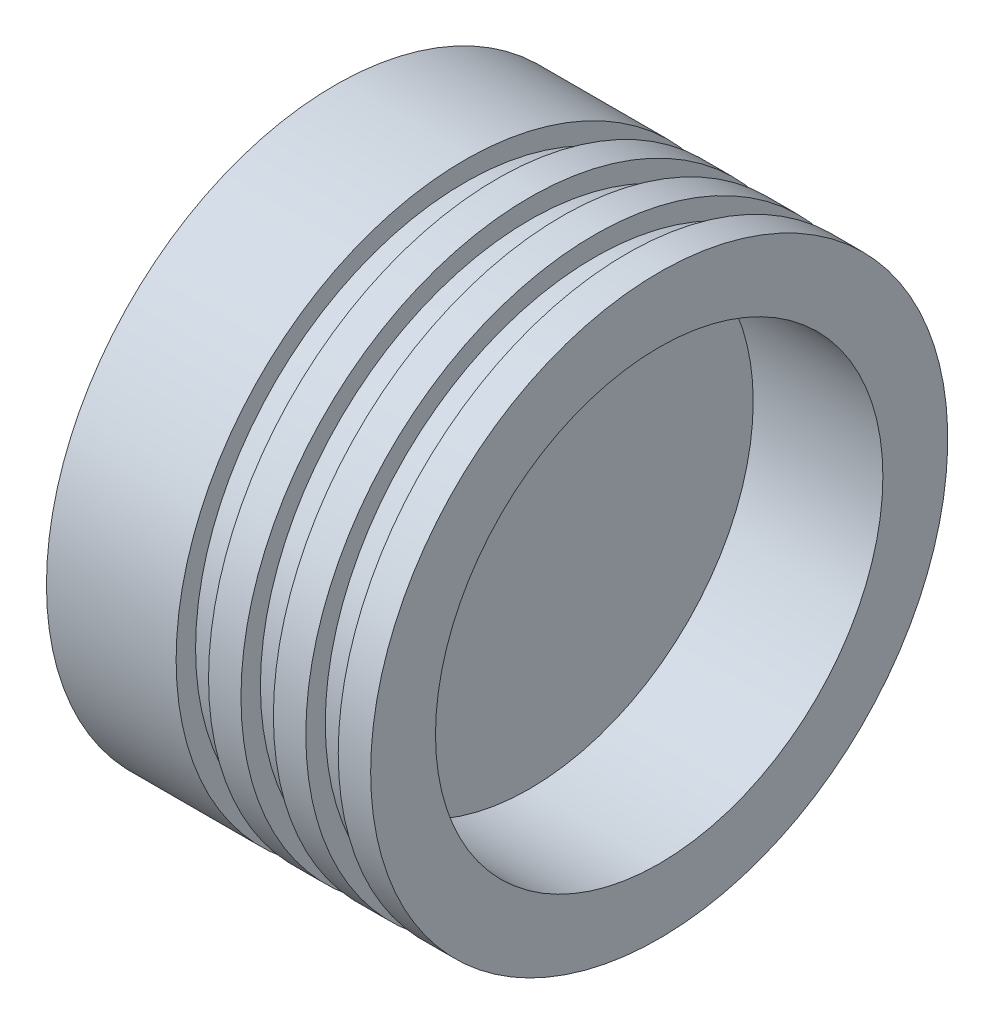
ISO-10303-21;
HEADER;
FILE_DESCRIPTION(('STEP AP214'),'2;1');
FILE_NAME('part.step','',(''),(''),'','','');
FILE_SCHEMA(('AUTOMOTIVE_DESIGN { 1 0 10303 214 1 1 1 1 }'));
ENDSEC;
DATA;
#1=APPLICATION_CONTEXT('core data for automotive mechanical design processes');
#2=APPLICATION_PROTOCOL_DEFINITION('international standard','automotive_design',2000,#1);
#3=PRODUCT_CONTEXT('',#1,'mechanical');
#4=PRODUCT('Part','Part','',(#3));
#5=PRODUCT_RELATED_PRODUCT_CATEGORY('part','',(#4));
#6=PRODUCT_DEFINITION_FORMATION('','',#4);
#7=PRODUCT_DEFINITION_CONTEXT('part definition',#1,'design');
#8=PRODUCT_DEFINITION('design','',#6,#7);
#9=PRODUCT_DEFINITION_SHAPE('','',#8);
#10=(LENGTH_UNIT() NAMED_UNIT(*) SI_UNIT(.MILLI.,.METRE.));
#11=(NAMED_UNIT(*) PLANE_ANGLE_UNIT() SI_UNIT($,.RADIAN.));
#12=(NAMED_UNIT(*) SI_UNIT($,.STERADIAN.) SOLID_ANGLE_UNIT());
#13=UNCERTAINTY_MEASURE_WITH_UNIT(LENGTH_MEASURE(1.E-05),#10,'distance_accuracy_value','');
#14=(GEOMETRIC_REPRESENTATION_CONTEXT(3) GLOBAL_UNCERTAINTY_ASSIGNED_CONTEXT((#13)) GLOBAL_UNIT_ASSIGNED_CONTEXT((#10,
#11,#12)) REPRESENTATION_CONTEXT('',''));
#15=CARTESIAN_POINT('',(0.,0.,0.));
#16=DIRECTION('',(0.,0.,1.));
#17=DIRECTION('',(1.,0.,0.));
#18=AXIS2_PLACEMENT_3D('',#15,#16,#17);
#19=CARTESIAN_POINT('',(0.,0.,0.));
#20=DIRECTION('',(1.,0.,0.));
#21=DIRECTION('',(0.,0.,-1.));
#22=AXIS2_PLACEMENT_3D('',#19,#20,#21);
#23=PLANE('',#22);
#24=CARTESIAN_POINT('',(0.,0.,0.));
#25=DIRECTION('',(-1.,0.,0.));
#26=DIRECTION('',(0.,0.,1.));
#27=AXIS2_PLACEMENT_3D('',#24,#25,#26);
#28=CIRCLE('',#27,44.5);
#29=CARTESIAN_POINT('',(0.,0.,44.5));
#30=VERTEX_POINT('',#29);
#31=EDGE_CURVE('E10',#30,#30,#28,.T.);
#32=ORIENTED_EDGE('',*,*,#31,.T.);
#33=EDGE_LOOP('',(#32));
#34=FACE_BOUND('',#33,.T.);
#35=ADVANCED_FACE('F35',(#34),#23,.F.);
#36=CARTESIAN_POINT('',(0.,0.,0.));
#37=DIRECTION('',(-1.,0.,0.));
#38=DIRECTION('',(0.,0.,1.));
#39=AXIS2_PLACEMENT_3D('',#36,#37,#38);
#40=CYLINDRICAL_SURFACE('',#39,44.5);
#41=ORIENTED_EDGE('',*,*,#31,.F.);
#42=EDGE_LOOP('',(#41));
#43=FACE_BOUND('',#42,.T.);
#44=CARTESIAN_POINT('',(20.,0.,0.));
#45=DIRECTION('',(-1.,0.,0.));
#46=DIRECTION('',(0.,0.,1.));
#47=AXIS2_PLACEMENT_3D('',#44,#45,#46);
#48=CIRCLE('',#47,44.5);
#49=CARTESIAN_POINT('',(20.,0.,44.5));
#50=VERTEX_POINT('',#49);
#51=EDGE_CURVE('E41',#50,#50,#48,.T.);
#52=ORIENTED_EDGE('',*,*,#51,.T.);
#53=EDGE_LOOP('',(#52));
#54=FACE_BOUND('',#53,.T.);
#55=ADVANCED_FACE('F103',(#43,#54),#40,.T.);
#56=CARTESIAN_POINT('',(20.,44.5,0.));
#57=DIRECTION('',(-1.,0.,0.));
#58=DIRECTION('',(0.,0.,1.));
#59=AXIS2_PLACEMENT_3D('',#56,#57,#58);
#60=PLANE('',#59);
#61=ORIENTED_EDGE('',*,*,#51,.F.);
#62=EDGE_LOOP('',(#61));
#63=FACE_BOUND('',#62,.T.);
#64=CARTESIAN_POINT('',(20.,0.,0.));
#65=DIRECTION('',(-1.,0.,0.));
#66=DIRECTION('',(0.,0.,1.));
#67=AXIS2_PLACEMENT_3D('',#64,#65,#66);
#68=CIRCLE('',#67,41.5);
#69=CARTESIAN_POINT('',(20.,0.,41.5));
#70=VERTEX_POINT('',#69);
#71=EDGE_CURVE('E45',#70,#70,#68,.T.);
#72=ORIENTED_EDGE('',*,*,#71,.T.);
#73=EDGE_LOOP('',(#72));
#74=FACE_BOUND('',#73,.T.);
#75=ADVANCED_FACE('F107',(#63,#74),#60,.F.);
#76=CARTESIAN_POINT('',(0.,0.,0.));
#77=DIRECTION('',(-1.,0.,0.));
#78=DIRECTION('',(0.,0.,1.));
#79=AXIS2_PLACEMENT_3D('',#76,#77,#78);
#80=CYLINDRICAL_SURFACE('',#79,41.5);
#81=ORIENTED_EDGE('',*,*,#71,.F.);
#82=EDGE_LOOP('',(#81));
#83=FACE_BOUND('',#82,.T.);
#84=CARTESIAN_POINT('',(25.,0.,0.));
#85=DIRECTION('',(-1.,0.,0.));
#86=DIRECTION('',(0.,0.,1.));
#87=AXIS2_PLACEMENT_3D('',#84,#85,#86);
#88=CIRCLE('',#87,41.5);
#89=CARTESIAN_POINT('',(25.,0.,41.5));
#90=VERTEX_POINT('',#89);
#91=EDGE_CURVE('E49',#90,#90,#88,.T.);
#92=ORIENTED_EDGE('',*,*,#91,.T.);
#93=EDGE_LOOP('',(#92));
#94=FACE_BOUND('',#93,.T.);
#95=ADVANCED_FACE('F112',(#83,#94),#80,.T.);
#96=CARTESIAN_POINT('',(25.,41.5,0.));
#97=DIRECTION('',(1.,0.,0.));
#98=DIRECTION('',(0.,0.,-1.));
#99=AXIS2_PLACEMENT_3D('',#96,#97,#98);
#100=PLANE('',#99);
#101=ORIENTED_EDGE('',*,*,#91,.F.);
#102=EDGE_LOOP('',(#101));
#103=FACE_BOUND('',#102,.T.);
#104=CARTESIAN_POINT('',(25.,0.,0.));
#105=DIRECTION('',(-1.,0.,0.));
#106=DIRECTION('',(0.,0.,1.));
#107=AXIS2_PLACEMENT_3D('',#104,#105,#106);
#108=CIRCLE('',#107,44.5);
#109=CARTESIAN_POINT('',(25.,0.,44.5));
#110=VERTEX_POINT('',#109);
#111=EDGE_CURVE('E54',#110,#110,#108,.T.);
#112=ORIENTED_EDGE('',*,*,#111,.T.);
#113=EDGE_LOOP('',(#112));
#114=FACE_BOUND('',#113,.T.);
#115=ADVANCED_FACE('F118',(#103,#114),#100,.F.);
#116=CARTESIAN_POINT('',(0.,0.,0.));
#117=DIRECTION('',(-1.,0.,0.));
#118=DIRECTION('',(0.,0.,1.));
#119=AXIS2_PLACEMENT_3D('',#116,#117,#118);
#120=CYLINDRICAL_SURFACE('',#119,44.5);
#121=ORIENTED_EDGE('',*,*,#111,.F.);
#122=EDGE_LOOP('',(#121));
#123=FACE_BOUND('',#122,.T.);
#124=CARTESIAN_POINT('',(30.,0.,0.));
#125=DIRECTION('',(-1.,0.,0.));
#126=DIRECTION('',(0.,0.,1.));
#127=AXIS2_PLACEMENT_3D('',#124,#125,#126);
#128=CIRCLE('',#127,44.5);
#129=CARTESIAN_POINT('',(30.,0.,44.5));
#130=VERTEX_POINT('',#129);
#131=EDGE_CURVE('E57',#130,#130,#128,.T.);
#132=ORIENTED_EDGE('',*,*,#131,.T.);
#133=EDGE_LOOP('',(#132));
#134=FACE_BOUND('',#133,.T.);
#135=ADVANCED_FACE('F122',(#123,#134),#120,.T.);
#136=CARTESIAN_POINT('',(30.,44.5,0.));
#137=DIRECTION('',(-1.,0.,0.));
#138=DIRECTION('',(0.,0.,1.));
#139=AXIS2_PLACEMENT_3D('',#136,#137,#138);
#140=PLANE('',#139);
#141=ORIENTED_EDGE('',*,*,#131,.F.);
#142=EDGE_LOOP('',(#141));
#143=FACE_BOUND('',#142,.T.);
#144=CARTESIAN_POINT('',(30.,0.,0.));
#145=DIRECTION('',(-1.,0.,0.));
#146=DIRECTION('',(0.,0.,1.));
#147=AXIS2_PLACEMENT_3D('',#144,#145,#146);
#148=CIRCLE('',#147,41.5);
#149=CARTESIAN_POINT('',(30.,0.,41.5));
#150=VERTEX_POINT('',#149);
#151=EDGE_CURVE('E60',#150,#150,#148,.T.);
#152=ORIENTED_EDGE('',*,*,#151,.T.);
#153=EDGE_LOOP('',(#152));
#154=FACE_BOUND('',#153,.T.);
#155=ADVANCED_FACE('F126',(#143,#154),#140,.F.);
#156=CARTESIAN_POINT('',(0.,0.,0.));
#157=DIRECTION('',(-1.,0.,0.));
#158=DIRECTION('',(0.,0.,1.));
#159=AXIS2_PLACEMENT_3D('',#156,#157,#158);
#160=CYLINDRICAL_SURFACE('',#159,41.5);
#161=ORIENTED_EDGE('',*,*,#151,.F.);
#162=EDGE_LOOP('',(#161));
#163=FACE_BOUND('',#162,.T.);
#164=CARTESIAN_POINT('',(35.,0.,0.));
#165=DIRECTION('',(-1.,0.,0.));
#166=DIRECTION('',(0.,0.,1.));
#167=AXIS2_PLACEMENT_3D('',#164,#165,#166);
#168=CIRCLE('',#167,41.5);
#169=CARTESIAN_POINT('',(35.,0.,41.5));
#170=VERTEX_POINT('',#169);
#171=EDGE_CURVE('E63',#170,#170,#168,.T.);
#172=ORIENTED_EDGE('',*,*,#171,.T.);
#173=EDGE_LOOP('',(#172));
#174=FACE_BOUND('',#173,.T.);
#175=ADVANCED_FACE('F130',(#163,#174),#160,.T.);
#176=CARTESIAN_POINT('',(35.,41.5,0.));
#177=DIRECTION('',(1.,0.,0.));
#178=DIRECTION('',(0.,0.,-1.));
#179=AXIS2_PLACEMENT_3D('',#176,#177,#178);
#180=PLANE('',#179);
#181=ORIENTED_EDGE('',*,*,#171,.F.);
#182=EDGE_LOOP('',(#181));
#183=FACE_BOUND('',#182,.T.);
#184=CARTESIAN_POINT('',(35.,0.,0.));
#185=DIRECTION('',(-1.,0.,0.));
#186=DIRECTION('',(0.,0.,1.));
#187=AXIS2_PLACEMENT_3D('',#184,#185,#186);
#188=CIRCLE('',#187,44.5);
#189=CARTESIAN_POINT('',(35.,0.,44.5));
#190=VERTEX_POINT('',#189);
#191=EDGE_CURVE('E66',#190,#190,#188,.T.);
#192=ORIENTED_EDGE('',*,*,#191,.T.);
#193=EDGE_LOOP('',(#192));
#194=FACE_BOUND('',#193,.T.);
#195=ADVANCED_FACE('F134',(#183,#194),#180,.F.);
#196=CARTESIAN_POINT('',(0.,0.,0.));
#197=DIRECTION('',(-1.,0.,0.));
#198=DIRECTION('',(0.,0.,1.));
#199=AXIS2_PLACEMENT_3D('',#196,#197,#198);
#200=CYLINDRICAL_SURFACE('',#199,44.5);
#201=ORIENTED_EDGE('',*,*,#191,.F.);
#202=EDGE_LOOP('',(#201));
#203=FACE_BOUND('',#202,.T.);
#204=CARTESIAN_POINT('',(40.,0.,0.));
#205=DIRECTION('',(-1.,0.,0.));
#206=DIRECTION('',(0.,0.,1.));
#207=AXIS2_PLACEMENT_3D('',#204,#205,#206);
#208=CIRCLE('',#207,44.5);
#209=CARTESIAN_POINT('',(40.,0.,44.5));
#210=VERTEX_POINT('',#209);
#211=EDGE_CURVE('E69',#210,#210,#208,.T.);
#212=ORIENTED_EDGE('',*,*,#211,.T.);
#213=EDGE_LOOP('',(#212));
#214=FACE_BOUND('',#213,.T.);
#215=ADVANCED_FACE('F138',(#203,#214),#200,.T.);
#216=CARTESIAN_POINT('',(40.,44.5,0.));
#217=DIRECTION('',(-1.,0.,0.));
#218=DIRECTION('',(0.,0.,1.));
#219=AXIS2_PLACEMENT_3D('',#216,#217,#218);
#220=PLANE('',#219);
#221=ORIENTED_EDGE('',*,*,#211,.F.);
#222=EDGE_LOOP('',(#221));
#223=FACE_BOUND('',#222,.T.);
#224=CARTESIAN_POINT('',(40.,0.,0.));
#225=DIRECTION('',(-1.,0.,0.));
#226=DIRECTION('',(0.,0.,1.));
#227=AXIS2_PLACEMENT_3D('',#224,#225,#226);
#228=CIRCLE('',#227,41.5);
#229=CARTESIAN_POINT('',(40.,0.,41.5));
#230=VERTEX_POINT('',#229);
#231=EDGE_CURVE('E72',#230,#230,#228,.T.);
#232=ORIENTED_EDGE('',*,*,#231,.T.);
#233=EDGE_LOOP('',(#232));
#234=FACE_BOUND('',#233,.T.);
#235=ADVANCED_FACE('F142',(#223,#234),#220,.F.);
#236=CARTESIAN_POINT('',(0.,0.,0.));
#237=DIRECTION('',(-1.,0.,0.));
#238=DIRECTION('',(0.,0.,1.));
#239=AXIS2_PLACEMENT_3D('',#236,#237,#238);
#240=CYLINDRICAL_SURFACE('',#239,41.5);
#241=ORIENTED_EDGE('',*,*,#231,.F.);
#242=EDGE_LOOP('',(#241));
#243=FACE_BOUND('',#242,.T.);
#244=CARTESIAN_POINT('',(45.,0.,0.));
#245=DIRECTION('',(-1.,0.,0.));
#246=DIRECTION('',(0.,0.,1.));
#247=AXIS2_PLACEMENT_3D('',#244,#245,#246);
#248=CIRCLE('',#247,41.5);
#249=CARTESIAN_POINT('',(45.,0.,41.5));
#250=VERTEX_POINT('',#249);
#251=EDGE_CURVE('E75',#250,#250,#248,.T.);
#252=ORIENTED_EDGE('',*,*,#251,.T.);
#253=EDGE_LOOP('',(#252));
#254=FACE_BOUND('',#253,.T.);
#255=ADVANCED_FACE('F146',(#243,#254),#240,.T.);
#256=CARTESIAN_POINT('',(45.,41.5,0.));
#257=DIRECTION('',(1.,0.,0.));
#258=DIRECTION('',(0.,0.,-1.));
#259=AXIS2_PLACEMENT_3D('',#256,#257,#258);
#260=PLANE('',#259);
#261=ORIENTED_EDGE('',*,*,#251,.F.);
#262=EDGE_LOOP('',(#261));
#263=FACE_BOUND('',#262,.T.);
#264=CARTESIAN_POINT('',(45.,0.,0.));
#265=DIRECTION('',(-1.,0.,0.));
#266=DIRECTION('',(0.,0.,1.));
#267=AXIS2_PLACEMENT_3D('',#264,#265,#266);
#268=CIRCLE('',#267,44.5);
#269=CARTESIAN_POINT('',(45.,0.,44.5));
#270=VERTEX_POINT('',#269);
#271=EDGE_CURVE('E78',#270,#270,#268,.T.);
#272=ORIENTED_EDGE('',*,*,#271,.T.);
#273=EDGE_LOOP('',(#272));
#274=FACE_BOUND('',#273,.T.);
#275=ADVANCED_FACE('F150',(#263,#274),#260,.F.);
#276=CARTESIAN_POINT('',(0.,0.,0.));
#277=DIRECTION('',(-1.,0.,0.));
#278=DIRECTION('',(0.,0.,1.));
#279=AXIS2_PLACEMENT_3D('',#276,#277,#278);
#280=CYLINDRICAL_SURFACE('',#279,44.5);
#281=ORIENTED_EDGE('',*,*,#271,.F.);
#282=EDGE_LOOP('',(#281));
#283=FACE_BOUND('',#282,.T.);
#284=CARTESIAN_POINT('',(50.,0.,0.));
#285=DIRECTION('',(-1.,0.,0.));
#286=DIRECTION('',(0.,0.,1.));
#287=AXIS2_PLACEMENT_3D('',#284,#285,#286);
#288=CIRCLE('',#287,44.5);
#289=CARTESIAN_POINT('',(50.,0.,44.5));
#290=VERTEX_POINT('',#289);
#291=EDGE_CURVE('E81',#290,#290,#288,.T.);
#292=ORIENTED_EDGE('',*,*,#291,.T.);
#293=EDGE_LOOP('',(#292));
#294=FACE_BOUND('',#293,.T.);
#295=ADVANCED_FACE('F154',(#283,#294),#280,.T.);
#296=CARTESIAN_POINT('',(50.,44.5,0.));
#297=DIRECTION('',(-1.,0.,0.));
#298=DIRECTION('',(0.,0.,1.));
#299=AXIS2_PLACEMENT_3D('',#296,#297,#298);
#300=PLANE('',#299);
#301=ORIENTED_EDGE('',*,*,#291,.F.);
#302=EDGE_LOOP('',(#301));
#303=FACE_BOUND('',#302,.T.);
#304=CARTESIAN_POINT('',(50.,0.,0.));
#305=DIRECTION('',(-1.,0.,0.));
#306=DIRECTION('',(0.,0.,1.));
#307=AXIS2_PLACEMENT_3D('',#304,#305,#306);
#308=CIRCLE('',#307,34.5);
#309=CARTESIAN_POINT('',(50.,0.,34.5));
#310=VERTEX_POINT('',#309);
#311=EDGE_CURVE('E84',#310,#310,#308,.T.);
#312=ORIENTED_EDGE('',*,*,#311,.T.);
#313=EDGE_LOOP('',(#312));
#314=FACE_BOUND('',#313,.T.);
#315=ADVANCED_FACE('F99',(#303,#314),#300,.F.);
#316=CARTESIAN_POINT('',(0.,0.,0.));
#317=DIRECTION('',(-1.,0.,0.));
#318=DIRECTION('',(0.,0.,1.));
#319=AXIS2_PLACEMENT_3D('',#316,#317,#318);
#320=CYLINDRICAL_SURFACE('',#319,34.5);
#321=ORIENTED_EDGE('',*,*,#311,.F.);
#322=EDGE_LOOP('',(#321));
#323=FACE_BOUND('',#322,.T.);
#324=CARTESIAN_POINT('',(30.,0.,0.));
#325=DIRECTION('',(-1.,0.,0.));
#326=DIRECTION('',(0.,0.,1.));
#327=AXIS2_PLACEMENT_3D('',#324,#325,#326);
#328=CIRCLE('',#327,34.5);
#329=CARTESIAN_POINT('',(30.,0.,34.5));
#330=VERTEX_POINT('',#329);
#331=EDGE_CURVE('E87',#330,#330,#328,.T.);
#332=ORIENTED_EDGE('',*,*,#331,.T.);
#333=EDGE_LOOP('',(#332));
#334=FACE_BOUND('',#333,.T.);
#335=ADVANCED_FACE('F91',(#323,#334),#320,.F.);
#336=CARTESIAN_POINT('',(30.,34.5,0.));
#337=DIRECTION('',(-1.,0.,0.));
#338=DIRECTION('',(0.,0.,1.));
#339=AXIS2_PLACEMENT_3D('',#336,#337,#338);
#340=PLANE('',#339);
#341=ORIENTED_EDGE('',*,*,#331,.F.);
#342=EDGE_LOOP('',(#341));
#343=FACE_BOUND('',#342,.T.);
#344=ADVANCED_FACE('F93',(#343),#340,.F.);
#345=CLOSED_SHELL('',(#35,#55,#75,#95,#115,#135,#155,#175,#195,#215,#235,#255,#275,#295,#315,
#335,#344));
#346=MANIFOLD_SOLID_BREP('B2',#345);
#347=ADVANCED_BREP_SHAPE_REPRESENTATION('',(#18,#346),#14);
#348=SHAPE_DEFINITION_REPRESENTATION(#9,#347);
ENDSEC;
END-ISO-10303-21;
